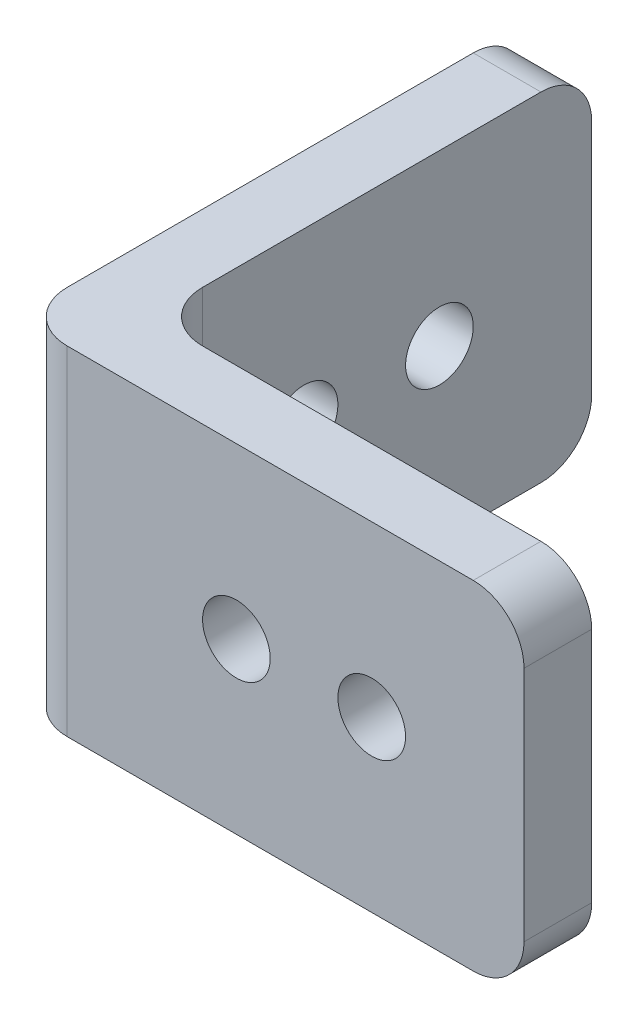
ISO-10303-21;
HEADER;
FILE_DESCRIPTION(('STEP AP214'),'2;1');
FILE_NAME('part.step','',(''),(''),'','','');
FILE_SCHEMA(('AUTOMOTIVE_DESIGN { 1 0 10303 214 1 1 1 1 }'));
ENDSEC;
DATA;
#1=APPLICATION_CONTEXT('core data for automotive mechanical design processes');
#2=APPLICATION_PROTOCOL_DEFINITION('international standard','automotive_design',2000,#1);
#3=PRODUCT_CONTEXT('',#1,'mechanical');
#4=PRODUCT('Part','Part','',(#3));
#5=PRODUCT_RELATED_PRODUCT_CATEGORY('part','',(#4));
#6=PRODUCT_DEFINITION_FORMATION('','',#4);
#7=PRODUCT_DEFINITION_CONTEXT('part definition',#1,'design');
#8=PRODUCT_DEFINITION('design','',#6,#7);
#9=PRODUCT_DEFINITION_SHAPE('','',#8);
#10=(LENGTH_UNIT() NAMED_UNIT(*) SI_UNIT(.MILLI.,.METRE.));
#11=(NAMED_UNIT(*) PLANE_ANGLE_UNIT() SI_UNIT($,.RADIAN.));
#12=(NAMED_UNIT(*) SI_UNIT($,.STERADIAN.) SOLID_ANGLE_UNIT());
#13=UNCERTAINTY_MEASURE_WITH_UNIT(LENGTH_MEASURE(1.E-05),#10,'distance_accuracy_value','');
#14=(GEOMETRIC_REPRESENTATION_CONTEXT(3) GLOBAL_UNCERTAINTY_ASSIGNED_CONTEXT((#13)) GLOBAL_UNIT_ASSIGNED_CONTEXT((#10,
#11,#12)) REPRESENTATION_CONTEXT('',''));
#15=CARTESIAN_POINT('',(0.,0.,0.));
#16=DIRECTION('',(0.,0.,1.));
#17=DIRECTION('',(1.,0.,0.));
#18=AXIS2_PLACEMENT_3D('',#15,#16,#17);
#19=CARTESIAN_POINT('',(30.,20.,0.));
#20=DIRECTION('',(0.,0.,-1.));
#21=DIRECTION('',(-1.,0.,0.));
#22=AXIS2_PLACEMENT_3D('',#19,#20,#21);
#23=PLANE('',#22);
#24=CARTESIAN_POINT('',(21.,10.,0.));
#25=DIRECTION('',(0.,0.,-1.));
#26=DIRECTION('',(-1.,0.,0.));
#27=AXIS2_PLACEMENT_3D('',#24,#25,#26);
#28=CIRCLE('',#27,2.);
#29=CARTESIAN_POINT('',(19.,10.,0.));
#30=VERTEX_POINT('',#29);
#31=EDGE_CURVE('E240',#30,#30,#28,.T.);
#32=ORIENTED_EDGE('',*,*,#31,.T.);
#33=EDGE_LOOP('',(#32));
#34=FACE_BOUND('',#33,.T.);
#35=CARTESIAN_POINT('',(13.,10.,0.));
#36=DIRECTION('',(0.,0.,-1.));
#37=DIRECTION('',(-1.,0.,0.));
#38=AXIS2_PLACEMENT_3D('',#35,#36,#37);
#39=CIRCLE('',#38,2.);
#40=CARTESIAN_POINT('',(11.,10.,0.));
#41=VERTEX_POINT('',#40);
#42=EDGE_CURVE('E248',#41,#41,#39,.T.);
#43=ORIENTED_EDGE('',*,*,#42,.T.);
#44=EDGE_LOOP('',(#43));
#45=FACE_BOUND('',#44,.T.);
#46=DIRECTION('',(1.,0.,0.));
#47=VECTOR('',#46,1.);
#48=CARTESIAN_POINT('',(30.,20.,0.));
#49=LINE('',#48,#47);
#50=CARTESIAN_POINT('',(3.00000000000001,20.,0.));
#51=VERTEX_POINT('',#50);
#52=CARTESIAN_POINT('',(27.,20.,0.));
#53=VERTEX_POINT('',#52);
#54=EDGE_CURVE('E143',#51,#53,#49,.T.);
#55=ORIENTED_EDGE('',*,*,#54,.F.);
#56=DIRECTION('',(0.,-1.,0.));
#57=VECTOR('',#56,1.);
#58=CARTESIAN_POINT('',(3.,20.,0.));
#59=LINE('',#58,#57);
#60=CARTESIAN_POINT('',(3.00000000000001,0.,0.));
#61=VERTEX_POINT('',#60);
#62=EDGE_CURVE('E128',#51,#61,#59,.T.);
#63=ORIENTED_EDGE('',*,*,#62,.T.);
#64=DIRECTION('',(1.,0.,0.));
#65=VECTOR('',#64,1.);
#66=CARTESIAN_POINT('',(30.,0.,0.));
#67=LINE('',#66,#65);
#68=CARTESIAN_POINT('',(27.,0.,0.));
#69=VERTEX_POINT('',#68);
#70=EDGE_CURVE('E140',#61,#69,#67,.T.);
#71=ORIENTED_EDGE('',*,*,#70,.T.);
#72=CARTESIAN_POINT('',(27.,3.,0.));
#73=DIRECTION('',(0.,0.,-1.));
#74=DIRECTION('',(-1.,0.,0.));
#75=AXIS2_PLACEMENT_3D('',#72,#73,#74);
#76=CIRCLE('',#75,3.);
#77=CARTESIAN_POINT('',(30.,3.,0.));
#78=VERTEX_POINT('',#77);
#79=EDGE_CURVE('E145',#69,#78,#76,.F.);
#80=ORIENTED_EDGE('',*,*,#79,.T.);
#81=DIRECTION('',(0.,-1.,0.));
#82=VECTOR('',#81,1.);
#83=CARTESIAN_POINT('',(30.,20.,0.));
#84=LINE('',#83,#82);
#85=CARTESIAN_POINT('',(30.,17.,0.));
#86=VERTEX_POINT('',#85);
#87=EDGE_CURVE('E174',#86,#78,#84,.T.);
#88=ORIENTED_EDGE('',*,*,#87,.F.);
#89=CARTESIAN_POINT('',(27.,17.,0.));
#90=DIRECTION('',(0.,0.,-1.));
#91=DIRECTION('',(-1.,0.,0.));
#92=AXIS2_PLACEMENT_3D('',#89,#90,#91);
#93=CIRCLE('',#92,3.);
#94=EDGE_CURVE('E177',#86,#53,#93,.F.);
#95=ORIENTED_EDGE('',*,*,#94,.T.);
#96=EDGE_LOOP('',(#55,#63,#71,#80,#88,#95));
#97=FACE_BOUND('',#96,.T.);
#98=ADVANCED_FACE('F34',(#34,#45,#97),#23,.F.);
#99=CARTESIAN_POINT('',(30.,20.,-4.));
#100=DIRECTION('',(-1.,0.,0.));
#101=DIRECTION('',(0.,0.,1.));
#102=AXIS2_PLACEMENT_3D('',#99,#100,#101);
#103=PLANE('',#102);
#104=ORIENTED_EDGE('',*,*,#87,.T.);
#105=DIRECTION('',(0.,0.,-1.));
#106=VECTOR('',#105,1.);
#107=CARTESIAN_POINT('',(30.,3.,-4.));
#108=LINE('',#107,#106);
#109=CARTESIAN_POINT('',(30.,3.,-4.));
#110=VERTEX_POINT('',#109);
#111=EDGE_CURVE('E212',#78,#110,#108,.T.);
#112=ORIENTED_EDGE('',*,*,#111,.T.);
#113=DIRECTION('',(0.,-1.,0.));
#114=VECTOR('',#113,1.);
#115=CARTESIAN_POINT('',(30.,20.,-4.));
#116=LINE('',#115,#114);
#117=CARTESIAN_POINT('',(30.,17.,-4.));
#118=VERTEX_POINT('',#117);
#119=EDGE_CURVE('E172',#118,#110,#116,.T.);
#120=ORIENTED_EDGE('',*,*,#119,.F.);
#121=DIRECTION('',(0.,0.,-1.));
#122=VECTOR('',#121,1.);
#123=CARTESIAN_POINT('',(30.,17.,-4.));
#124=LINE('',#123,#122);
#125=EDGE_CURVE('E210',#118,#86,#124,.F.);
#126=ORIENTED_EDGE('',*,*,#125,.T.);
#127=EDGE_LOOP('',(#104,#112,#120,#126));
#128=FACE_BOUND('',#127,.T.);
#129=ADVANCED_FACE('F268',(#128),#103,.F.);
#130=CARTESIAN_POINT('',(4.,20.,-4.));
#131=DIRECTION('',(0.,0.,1.));
#132=DIRECTION('',(1.,0.,0.));
#133=AXIS2_PLACEMENT_3D('',#130,#131,#132);
#134=PLANE('',#133);
#135=CARTESIAN_POINT('',(21.,10.,-4.));
#136=DIRECTION('',(0.,0.,-1.));
#137=DIRECTION('',(-1.,0.,0.));
#138=AXIS2_PLACEMENT_3D('',#135,#136,#137);
#139=CIRCLE('',#138,2.);
#140=CARTESIAN_POINT('',(19.,10.,-4.));
#141=VERTEX_POINT('',#140);
#142=EDGE_CURVE('E251',#141,#141,#139,.T.);
#143=ORIENTED_EDGE('',*,*,#142,.F.);
#144=EDGE_LOOP('',(#143));
#145=FACE_BOUND('',#144,.T.);
#146=CARTESIAN_POINT('',(13.,10.,-4.));
#147=DIRECTION('',(0.,0.,-1.));
#148=DIRECTION('',(-1.,0.,0.));
#149=AXIS2_PLACEMENT_3D('',#146,#147,#148);
#150=CIRCLE('',#149,2.);
#151=CARTESIAN_POINT('',(11.,10.,-4.));
#152=VERTEX_POINT('',#151);
#153=EDGE_CURVE('E245',#152,#152,#150,.T.);
#154=ORIENTED_EDGE('',*,*,#153,.F.);
#155=EDGE_LOOP('',(#154));
#156=FACE_BOUND('',#155,.T.);
#157=DIRECTION('',(-1.,0.,0.));
#158=VECTOR('',#157,1.);
#159=CARTESIAN_POINT('',(4.,0.,-4.));
#160=LINE('',#159,#158);
#161=CARTESIAN_POINT('',(27.,0.,-4.));
#162=VERTEX_POINT('',#161);
#163=CARTESIAN_POINT('',(7.,0.,-4.));
#164=VERTEX_POINT('',#163);
#165=EDGE_CURVE('E149',#162,#164,#160,.T.);
#166=ORIENTED_EDGE('',*,*,#165,.T.);
#167=DIRECTION('',(0.,-1.,0.));
#168=VECTOR('',#167,1.);
#169=CARTESIAN_POINT('',(7.,20.,-4.));
#170=LINE('',#169,#168);
#171=CARTESIAN_POINT('',(7.,20.,-4.));
#172=VERTEX_POINT('',#171);
#173=EDGE_CURVE('E208',#164,#172,#170,.F.);
#174=ORIENTED_EDGE('',*,*,#173,.T.);
#175=DIRECTION('',(-1.,0.,0.));
#176=VECTOR('',#175,1.);
#177=CARTESIAN_POINT('',(4.,20.,-4.));
#178=LINE('',#177,#176);
#179=CARTESIAN_POINT('',(27.,20.,-4.));
#180=VERTEX_POINT('',#179);
#181=EDGE_CURVE('E228',#180,#172,#178,.T.);
#182=ORIENTED_EDGE('',*,*,#181,.F.);
#183=CARTESIAN_POINT('',(27.,17.,-4.));
#184=DIRECTION('',(0.,0.,1.));
#185=DIRECTION('',(1.,0.,0.));
#186=AXIS2_PLACEMENT_3D('',#183,#184,#185);
#187=CIRCLE('',#186,3.);
#188=EDGE_CURVE('E57',#180,#118,#187,.F.);
#189=ORIENTED_EDGE('',*,*,#188,.T.);
#190=ORIENTED_EDGE('',*,*,#119,.T.);
#191=CARTESIAN_POINT('',(27.,3.,-4.));
#192=DIRECTION('',(0.,0.,1.));
#193=DIRECTION('',(1.,0.,0.));
#194=AXIS2_PLACEMENT_3D('',#191,#192,#193);
#195=CIRCLE('',#194,3.);
#196=EDGE_CURVE('E49',#110,#162,#195,.F.);
#197=ORIENTED_EDGE('',*,*,#196,.T.);
#198=EDGE_LOOP('',(#166,#174,#182,#189,#190,#197));
#199=FACE_BOUND('',#198,.T.);
#200=ADVANCED_FACE('F217',(#145,#156,#199),#134,.F.);
#201=CARTESIAN_POINT('',(4.,20.,-30.));
#202=DIRECTION('',(-1.,0.,0.));
#203=DIRECTION('',(0.,0.,1.));
#204=AXIS2_PLACEMENT_3D('',#201,#202,#203);
#205=PLANE('',#204);
#206=CARTESIAN_POINT('',(4.,10.,-13.));
#207=DIRECTION('',(1.,0.,0.));
#208=DIRECTION('',(0.,0.,-1.));
#209=AXIS2_PLACEMENT_3D('',#206,#207,#208);
#210=CIRCLE('',#209,2.);
#211=CARTESIAN_POINT('',(4.,10.,-15.));
#212=VERTEX_POINT('',#211);
#213=EDGE_CURVE('E156',#212,#212,#210,.T.);
#214=ORIENTED_EDGE('',*,*,#213,.F.);
#215=EDGE_LOOP('',(#214));
#216=FACE_BOUND('',#215,.T.);
#217=CARTESIAN_POINT('',(4.,10.,-21.));
#218=DIRECTION('',(1.,0.,0.));
#219=DIRECTION('',(0.,0.,-1.));
#220=AXIS2_PLACEMENT_3D('',#217,#218,#219);
#221=CIRCLE('',#220,2.);
#222=CARTESIAN_POINT('',(4.,10.,-23.));
#223=VERTEX_POINT('',#222);
#224=EDGE_CURVE('E236',#223,#223,#221,.T.);
#225=ORIENTED_EDGE('',*,*,#224,.F.);
#226=EDGE_LOOP('',(#225));
#227=FACE_BOUND('',#226,.T.);
#228=DIRECTION('',(0.,-1.,0.));
#229=VECTOR('',#228,1.);
#230=CARTESIAN_POINT('',(4.,20.,-30.));
#231=LINE('',#230,#229);
#232=CARTESIAN_POINT('',(4.,17.,-30.));
#233=VERTEX_POINT('',#232);
#234=CARTESIAN_POINT('',(4.,3.,-30.));
#235=VERTEX_POINT('',#234);
#236=EDGE_CURVE('E169',#233,#235,#231,.T.);
#237=ORIENTED_EDGE('',*,*,#236,.F.);
#238=CARTESIAN_POINT('',(4.,17.,-27.));
#239=DIRECTION('',(-1.,0.,0.));
#240=DIRECTION('',(0.,0.,1.));
#241=AXIS2_PLACEMENT_3D('',#238,#239,#240);
#242=CIRCLE('',#241,3.);
#243=CARTESIAN_POINT('',(4.,20.,-27.));
#244=VERTEX_POINT('',#243);
#245=EDGE_CURVE('E204',#233,#244,#242,.F.);
#246=ORIENTED_EDGE('',*,*,#245,.T.);
#247=DIRECTION('',(0.,0.,-1.));
#248=VECTOR('',#247,1.);
#249=CARTESIAN_POINT('',(4.,20.,-30.));
#250=LINE('',#249,#248);
#251=CARTESIAN_POINT('',(4.,20.,-7.00000000000001));
#252=VERTEX_POINT('',#251);
#253=EDGE_CURVE('E226',#252,#244,#250,.T.);
#254=ORIENTED_EDGE('',*,*,#253,.F.);
#255=DIRECTION('',(0.,-1.,0.));
#256=VECTOR('',#255,1.);
#257=CARTESIAN_POINT('',(4.,0.,-7.));
#258=LINE('',#257,#256);
#259=CARTESIAN_POINT('',(4.,0.,-7.00000000000001));
#260=VERTEX_POINT('',#259);
#261=EDGE_CURVE('E199',#252,#260,#258,.T.);
#262=ORIENTED_EDGE('',*,*,#261,.T.);
#263=DIRECTION('',(0.,0.,-1.));
#264=VECTOR('',#263,1.);
#265=CARTESIAN_POINT('',(4.,0.,-30.));
#266=LINE('',#265,#264);
#267=CARTESIAN_POINT('',(4.,0.,-27.));
#268=VERTEX_POINT('',#267);
#269=EDGE_CURVE('E153',#260,#268,#266,.T.);
#270=ORIENTED_EDGE('',*,*,#269,.T.);
#271=CARTESIAN_POINT('',(4.,3.,-27.));
#272=DIRECTION('',(-1.,0.,0.));
#273=DIRECTION('',(0.,0.,1.));
#274=AXIS2_PLACEMENT_3D('',#271,#272,#273);
#275=CIRCLE('',#274,3.);
#276=EDGE_CURVE('E202',#268,#235,#275,.F.);
#277=ORIENTED_EDGE('',*,*,#276,.T.);
#278=EDGE_LOOP('',(#237,#246,#254,#262,#270,#277));
#279=FACE_BOUND('',#278,.T.);
#280=ADVANCED_FACE('F231',(#216,#227,#279),#205,.F.);
#281=CARTESIAN_POINT('',(0.,20.,-30.));
#282=DIRECTION('',(0.,0.,1.));
#283=DIRECTION('',(1.,0.,0.));
#284=AXIS2_PLACEMENT_3D('',#281,#282,#283);
#285=PLANE('',#284);
#286=DIRECTION('',(0.,-1.,0.));
#287=VECTOR('',#286,1.);
#288=CARTESIAN_POINT('',(0.,20.,-30.));
#289=LINE('',#288,#287);
#290=CARTESIAN_POINT('',(0.,17.,-30.));
#291=VERTEX_POINT('',#290);
#292=CARTESIAN_POINT('',(0.,3.,-30.));
#293=VERTEX_POINT('',#292);
#294=EDGE_CURVE('E166',#291,#293,#289,.T.);
#295=ORIENTED_EDGE('',*,*,#294,.F.);
#296=DIRECTION('',(-1.,0.,0.));
#297=VECTOR('',#296,1.);
#298=CARTESIAN_POINT('',(0.,17.,-30.));
#299=LINE('',#298,#297);
#300=EDGE_CURVE('E197',#291,#233,#299,.F.);
#301=ORIENTED_EDGE('',*,*,#300,.T.);
#302=ORIENTED_EDGE('',*,*,#236,.T.);
#303=DIRECTION('',(-1.,0.,0.));
#304=VECTOR('',#303,1.);
#305=CARTESIAN_POINT('',(0.,3.,-30.));
#306=LINE('',#305,#304);
#307=EDGE_CURVE('E194',#235,#293,#306,.T.);
#308=ORIENTED_EDGE('',*,*,#307,.T.);
#309=EDGE_LOOP('',(#295,#301,#302,#308));
#310=FACE_BOUND('',#309,.T.);
#311=ADVANCED_FACE('F320',(#310),#285,.F.);
#312=CARTESIAN_POINT('',(0.,20.,0.));
#313=DIRECTION('',(1.,0.,0.));
#314=DIRECTION('',(0.,0.,-1.));
#315=AXIS2_PLACEMENT_3D('',#312,#313,#314);
#316=PLANE('',#315);
#317=CARTESIAN_POINT('',(0.,10.,-13.));
#318=DIRECTION('',(1.,0.,0.));
#319=DIRECTION('',(0.,0.,-1.));
#320=AXIS2_PLACEMENT_3D('',#317,#318,#319);
#321=CIRCLE('',#320,2.);
#322=CARTESIAN_POINT('',(0.,10.,-15.));
#323=VERTEX_POINT('',#322);
#324=EDGE_CURVE('E150',#323,#323,#321,.T.);
#325=ORIENTED_EDGE('',*,*,#324,.T.);
#326=EDGE_LOOP('',(#325));
#327=FACE_BOUND('',#326,.T.);
#328=CARTESIAN_POINT('',(0.,10.,-21.));
#329=DIRECTION('',(1.,0.,0.));
#330=DIRECTION('',(0.,0.,-1.));
#331=AXIS2_PLACEMENT_3D('',#328,#329,#330);
#332=CIRCLE('',#331,2.);
#333=CARTESIAN_POINT('',(0.,10.,-23.));
#334=VERTEX_POINT('',#333);
#335=EDGE_CURVE('E239',#334,#334,#332,.T.);
#336=ORIENTED_EDGE('',*,*,#335,.T.);
#337=EDGE_LOOP('',(#336));
#338=FACE_BOUND('',#337,.T.);
#339=DIRECTION('',(0.,0.,1.));
#340=VECTOR('',#339,1.);
#341=CARTESIAN_POINT('',(0.,0.,0.));
#342=LINE('',#341,#340);
#343=CARTESIAN_POINT('',(0.,0.,-27.));
#344=VERTEX_POINT('',#343);
#345=CARTESIAN_POINT('',(0.,0.,-3.));
#346=VERTEX_POINT('',#345);
#347=EDGE_CURVE('E164',#344,#346,#342,.T.);
#348=ORIENTED_EDGE('',*,*,#347,.T.);
#349=DIRECTION('',(0.,-1.,0.));
#350=VECTOR('',#349,1.);
#351=CARTESIAN_POINT('',(0.,20.,-3.));
#352=LINE('',#351,#350);
#353=CARTESIAN_POINT('',(0.,20.,-3.));
#354=VERTEX_POINT('',#353);
#355=EDGE_CURVE('E129',#346,#354,#352,.F.);
#356=ORIENTED_EDGE('',*,*,#355,.T.);
#357=DIRECTION('',(0.,0.,1.));
#358=VECTOR('',#357,1.);
#359=CARTESIAN_POINT('',(0.,20.,0.));
#360=LINE('',#359,#358);
#361=CARTESIAN_POINT('',(0.,20.,-27.));
#362=VERTEX_POINT('',#361);
#363=EDGE_CURVE('E159',#362,#354,#360,.T.);
#364=ORIENTED_EDGE('',*,*,#363,.F.);
#365=CARTESIAN_POINT('',(0.,17.,-27.));
#366=DIRECTION('',(1.,0.,0.));
#367=DIRECTION('',(0.,0.,-1.));
#368=AXIS2_PLACEMENT_3D('',#365,#366,#367);
#369=CIRCLE('',#368,3.);
#370=EDGE_CURVE('E183',#362,#291,#369,.F.);
#371=ORIENTED_EDGE('',*,*,#370,.T.);
#372=ORIENTED_EDGE('',*,*,#294,.T.);
#373=CARTESIAN_POINT('',(0.,3.,-27.));
#374=DIRECTION('',(1.,0.,0.));
#375=DIRECTION('',(0.,0.,-1.));
#376=AXIS2_PLACEMENT_3D('',#373,#374,#375);
#377=CIRCLE('',#376,3.);
#378=EDGE_CURVE('E134',#293,#344,#377,.F.);
#379=ORIENTED_EDGE('',*,*,#378,.T.);
#380=EDGE_LOOP('',(#348,#356,#364,#371,#372,#379));
#381=FACE_BOUND('',#380,.T.);
#382=ADVANCED_FACE('F314',(#327,#338,#381),#316,.F.);
#383=CARTESIAN_POINT('',(0.,20.,0.));
#384=DIRECTION('',(0.,-1.,0.));
#385=DIRECTION('',(0.,0.,-1.));
#386=AXIS2_PLACEMENT_3D('',#383,#384,#385);
#387=PLANE('',#386);
#388=ORIENTED_EDGE('',*,*,#363,.T.);
#389=CARTESIAN_POINT('',(3.,20.,-3.));
#390=DIRECTION('',(0.,-1.,0.));
#391=DIRECTION('',(0.,0.,-1.));
#392=AXIS2_PLACEMENT_3D('',#389,#390,#391);
#393=CIRCLE('',#392,3.);
#394=EDGE_CURVE('E192',#354,#51,#393,.F.);
#395=ORIENTED_EDGE('',*,*,#394,.T.);
#396=ORIENTED_EDGE('',*,*,#54,.T.);
#397=DIRECTION('',(0.,0.,-1.));
#398=VECTOR('',#397,1.);
#399=CARTESIAN_POINT('',(27.,20.,0.));
#400=LINE('',#399,#398);
#401=EDGE_CURVE('E186',#53,#180,#400,.T.);
#402=ORIENTED_EDGE('',*,*,#401,.T.);
#403=ORIENTED_EDGE('',*,*,#181,.T.);
#404=CARTESIAN_POINT('',(7.,20.,-7.));
#405=DIRECTION('',(0.,-1.,0.));
#406=DIRECTION('',(0.,0.,-1.));
#407=AXIS2_PLACEMENT_3D('',#404,#405,#406);
#408=CIRCLE('',#407,3.);
#409=EDGE_CURVE('E11',#172,#252,#408,.T.);
#410=ORIENTED_EDGE('',*,*,#409,.T.);
#411=ORIENTED_EDGE('',*,*,#253,.T.);
#412=DIRECTION('',(-1.,0.,0.));
#413=VECTOR('',#412,1.);
#414=CARTESIAN_POINT('',(0.,20.,-27.));
#415=LINE('',#414,#413);
#416=EDGE_CURVE('E189',#244,#362,#415,.T.);
#417=ORIENTED_EDGE('',*,*,#416,.T.);
#418=EDGE_LOOP('',(#388,#395,#396,#402,#403,#410,#411,#417));
#419=FACE_BOUND('',#418,.T.);
#420=ADVANCED_FACE('F225',(#419),#387,.F.);
#421=CARTESIAN_POINT('',(0.,0.,0.));
#422=DIRECTION('',(0.,-1.,0.));
#423=DIRECTION('',(0.,0.,-1.));
#424=AXIS2_PLACEMENT_3D('',#421,#422,#423);
#425=PLANE('',#424);
#426=ORIENTED_EDGE('',*,*,#70,.F.);
#427=CARTESIAN_POINT('',(3.,0.,-3.));
#428=DIRECTION('',(0.,-1.,0.));
#429=DIRECTION('',(0.,0.,-1.));
#430=AXIS2_PLACEMENT_3D('',#427,#428,#429);
#431=CIRCLE('',#430,3.);
#432=EDGE_CURVE('E124',#61,#346,#431,.T.);
#433=ORIENTED_EDGE('',*,*,#432,.T.);
#434=ORIENTED_EDGE('',*,*,#347,.F.);
#435=DIRECTION('',(-1.,0.,0.));
#436=VECTOR('',#435,1.);
#437=CARTESIAN_POINT('',(4.,0.,-27.));
#438=LINE('',#437,#436);
#439=EDGE_CURVE('E135',#344,#268,#438,.F.);
#440=ORIENTED_EDGE('',*,*,#439,.T.);
#441=ORIENTED_EDGE('',*,*,#269,.F.);
#442=CARTESIAN_POINT('',(7.,0.,-7.));
#443=DIRECTION('',(0.,-1.,0.));
#444=DIRECTION('',(0.,0.,-1.));
#445=AXIS2_PLACEMENT_3D('',#442,#443,#444);
#446=CIRCLE('',#445,3.);
#447=EDGE_CURVE('E42',#260,#164,#446,.F.);
#448=ORIENTED_EDGE('',*,*,#447,.T.);
#449=ORIENTED_EDGE('',*,*,#165,.F.);
#450=DIRECTION('',(0.,0.,-1.));
#451=VECTOR('',#450,1.);
#452=CARTESIAN_POINT('',(27.,0.,0.));
#453=LINE('',#452,#451);
#454=EDGE_CURVE('E144',#162,#69,#453,.F.);
#455=ORIENTED_EDGE('',*,*,#454,.T.);
#456=EDGE_LOOP('',(#426,#433,#434,#440,#441,#448,#449,#455));
#457=FACE_BOUND('',#456,.T.);
#458=ADVANCED_FACE('F147',(#457),#425,.T.);
#459=CARTESIAN_POINT('',(0.,10.,-21.));
#460=DIRECTION('',(1.,0.,0.));
#461=DIRECTION('',(0.,0.,-1.));
#462=AXIS2_PLACEMENT_3D('',#459,#460,#461);
#463=CYLINDRICAL_SURFACE('',#462,2.);
#464=ORIENTED_EDGE('',*,*,#335,.F.);
#465=EDGE_LOOP('',(#464));
#466=FACE_BOUND('',#465,.T.);
#467=ORIENTED_EDGE('',*,*,#224,.T.);
#468=EDGE_LOOP('',(#467));
#469=FACE_BOUND('',#468,.T.);
#470=ADVANCED_FACE('F279',(#466,#469),#463,.F.);
#471=CARTESIAN_POINT('',(0.,10.,-13.));
#472=DIRECTION('',(1.,0.,0.));
#473=DIRECTION('',(0.,0.,-1.));
#474=AXIS2_PLACEMENT_3D('',#471,#472,#473);
#475=CYLINDRICAL_SURFACE('',#474,2.);
#476=ORIENTED_EDGE('',*,*,#324,.F.);
#477=EDGE_LOOP('',(#476));
#478=FACE_BOUND('',#477,.T.);
#479=ORIENTED_EDGE('',*,*,#213,.T.);
#480=EDGE_LOOP('',(#479));
#481=FACE_BOUND('',#480,.T.);
#482=ADVANCED_FACE('F273',(#478,#481),#475,.F.);
#483=CARTESIAN_POINT('',(13.,10.,0.));
#484=DIRECTION('',(0.,0.,-1.));
#485=DIRECTION('',(-1.,0.,0.));
#486=AXIS2_PLACEMENT_3D('',#483,#484,#485);
#487=CYLINDRICAL_SURFACE('',#486,2.);
#488=ORIENTED_EDGE('',*,*,#42,.F.);
#489=EDGE_LOOP('',(#488));
#490=FACE_BOUND('',#489,.T.);
#491=ORIENTED_EDGE('',*,*,#153,.T.);
#492=EDGE_LOOP('',(#491));
#493=FACE_BOUND('',#492,.T.);
#494=ADVANCED_FACE('F262',(#490,#493),#487,.F.);
#495=CARTESIAN_POINT('',(21.,10.,0.));
#496=DIRECTION('',(0.,0.,-1.));
#497=DIRECTION('',(-1.,0.,0.));
#498=AXIS2_PLACEMENT_3D('',#495,#496,#497);
#499=CYLINDRICAL_SURFACE('',#498,2.);
#500=ORIENTED_EDGE('',*,*,#31,.F.);
#501=EDGE_LOOP('',(#500));
#502=FACE_BOUND('',#501,.T.);
#503=ORIENTED_EDGE('',*,*,#142,.T.);
#504=EDGE_LOOP('',(#503));
#505=FACE_BOUND('',#504,.T.);
#506=ADVANCED_FACE('F259',(#502,#505),#499,.F.);
#507=CARTESIAN_POINT('',(3.,20.,-3.));
#508=DIRECTION('',(0.,-1.,0.));
#509=DIRECTION('',(0.,0.,-1.));
#510=AXIS2_PLACEMENT_3D('',#507,#508,#509);
#511=CYLINDRICAL_SURFACE('',#510,3.);
#512=ORIENTED_EDGE('',*,*,#394,.F.);
#513=ORIENTED_EDGE('',*,*,#355,.F.);
#514=ORIENTED_EDGE('',*,*,#432,.F.);
#515=ORIENTED_EDGE('',*,*,#62,.F.);
#516=EDGE_LOOP('',(#512,#513,#514,#515));
#517=FACE_BOUND('',#516,.T.);
#518=ADVANCED_FACE('F127',(#517),#511,.T.);
#519=CARTESIAN_POINT('',(0.,17.,-27.));
#520=DIRECTION('',(-1.,0.,0.));
#521=DIRECTION('',(0.,0.,1.));
#522=AXIS2_PLACEMENT_3D('',#519,#520,#521);
#523=CYLINDRICAL_SURFACE('',#522,3.);
#524=ORIENTED_EDGE('',*,*,#245,.F.);
#525=ORIENTED_EDGE('',*,*,#300,.F.);
#526=ORIENTED_EDGE('',*,*,#370,.F.);
#527=ORIENTED_EDGE('',*,*,#416,.F.);
#528=EDGE_LOOP('',(#524,#525,#526,#527));
#529=FACE_BOUND('',#528,.T.);
#530=ADVANCED_FACE('F293',(#529),#523,.T.);
#531=CARTESIAN_POINT('',(0.,3.,-27.));
#532=DIRECTION('',(1.,0.,0.));
#533=DIRECTION('',(0.,0.,-1.));
#534=AXIS2_PLACEMENT_3D('',#531,#532,#533);
#535=CYLINDRICAL_SURFACE('',#534,3.);
#536=ORIENTED_EDGE('',*,*,#276,.F.);
#537=ORIENTED_EDGE('',*,*,#439,.F.);
#538=ORIENTED_EDGE('',*,*,#378,.F.);
#539=ORIENTED_EDGE('',*,*,#307,.F.);
#540=EDGE_LOOP('',(#536,#537,#538,#539));
#541=FACE_BOUND('',#540,.T.);
#542=ADVANCED_FACE('F296',(#541),#535,.T.);
#543=CARTESIAN_POINT('',(7.,20.,-7.));
#544=DIRECTION('',(0.,1.,0.));
#545=DIRECTION('',(0.,0.,1.));
#546=AXIS2_PLACEMENT_3D('',#543,#544,#545);
#547=CYLINDRICAL_SURFACE('',#546,3.);
#548=ORIENTED_EDGE('',*,*,#409,.F.);
#549=ORIENTED_EDGE('',*,*,#173,.F.);
#550=ORIENTED_EDGE('',*,*,#447,.F.);
#551=ORIENTED_EDGE('',*,*,#261,.F.);
#552=EDGE_LOOP('',(#548,#549,#550,#551));
#553=FACE_BOUND('',#552,.T.);
#554=ADVANCED_FACE('F220',(#553),#547,.F.);
#555=CARTESIAN_POINT('',(27.,3.,-4.));
#556=DIRECTION('',(0.,0.,1.));
#557=DIRECTION('',(1.,0.,0.));
#558=AXIS2_PLACEMENT_3D('',#555,#556,#557);
#559=CYLINDRICAL_SURFACE('',#558,3.);
#560=ORIENTED_EDGE('',*,*,#79,.F.);
#561=ORIENTED_EDGE('',*,*,#454,.F.);
#562=ORIENTED_EDGE('',*,*,#196,.F.);
#563=ORIENTED_EDGE('',*,*,#111,.F.);
#564=EDGE_LOOP('',(#560,#561,#562,#563));
#565=FACE_BOUND('',#564,.T.);
#566=ADVANCED_FACE('F302',(#565),#559,.T.);
#567=CARTESIAN_POINT('',(27.,17.,0.));
#568=DIRECTION('',(0.,0.,-1.));
#569=DIRECTION('',(-1.,0.,0.));
#570=AXIS2_PLACEMENT_3D('',#567,#568,#569);
#571=CYLINDRICAL_SURFACE('',#570,3.);
#572=ORIENTED_EDGE('',*,*,#94,.F.);
#573=ORIENTED_EDGE('',*,*,#125,.F.);
#574=ORIENTED_EDGE('',*,*,#188,.F.);
#575=ORIENTED_EDGE('',*,*,#401,.F.);
#576=EDGE_LOOP('',(#572,#573,#574,#575));
#577=FACE_BOUND('',#576,.T.);
#578=ADVANCED_FACE('F36',(#577),#571,.T.);
#579=CLOSED_SHELL('',(#98,#129,#200,#280,#311,#382,#420,#458,#470,#482,#494,#506,#518,#530,#542,
#554,#566,#578));
#580=MANIFOLD_SOLID_BREP('B2',#579);
#581=ADVANCED_BREP_SHAPE_REPRESENTATION('',(#18,#580),#14);
#582=SHAPE_DEFINITION_REPRESENTATION(#9,#581);
ENDSEC;
END-ISO-10303-21;
